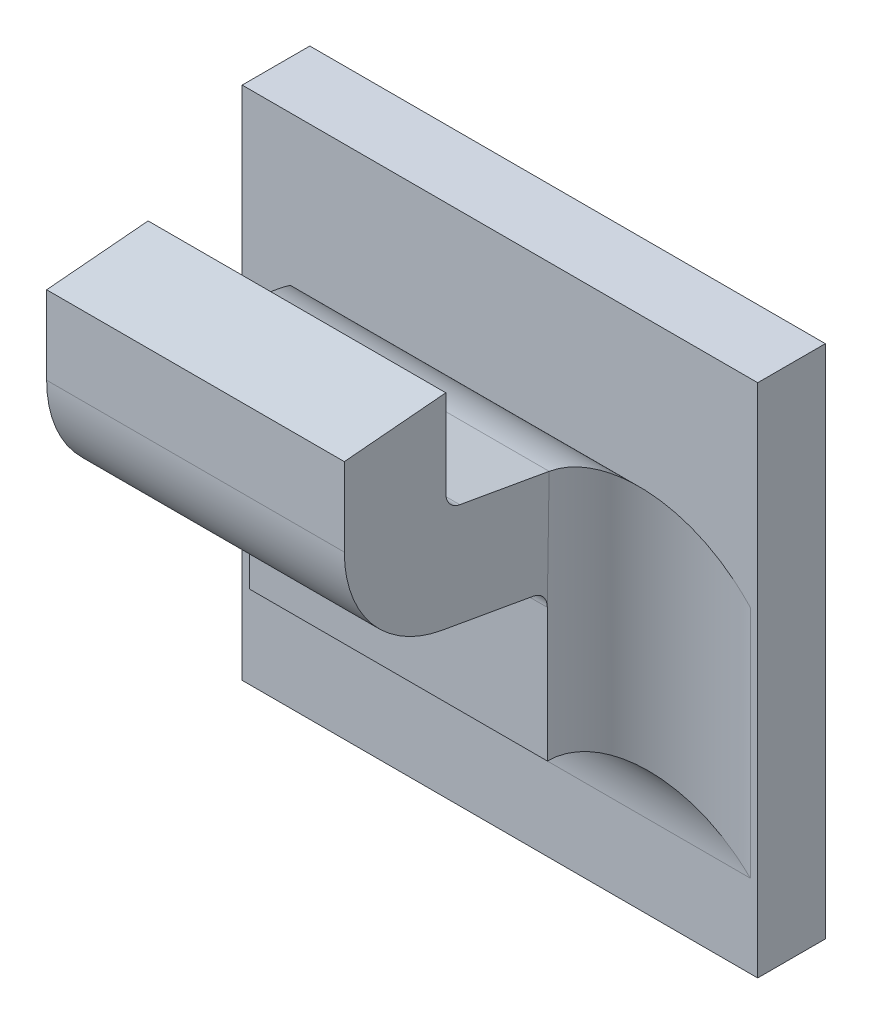
ISO-10303-21;
HEADER;
FILE_DESCRIPTION(('STEP AP214'),'2;1');
FILE_NAME('part.step','',(''),(''),'','','');
FILE_SCHEMA(('AUTOMOTIVE_DESIGN { 1 0 10303 214 1 1 1 1 }'));
ENDSEC;
DATA;
#1=APPLICATION_CONTEXT('core data for automotive mechanical design processes');
#2=APPLICATION_PROTOCOL_DEFINITION('international standard','automotive_design',2000,#1);
#3=PRODUCT_CONTEXT('',#1,'mechanical');
#4=PRODUCT('Part','Part','',(#3));
#5=PRODUCT_RELATED_PRODUCT_CATEGORY('part','',(#4));
#6=PRODUCT_DEFINITION_FORMATION('','',#4);
#7=PRODUCT_DEFINITION_CONTEXT('part definition',#1,'design');
#8=PRODUCT_DEFINITION('design','',#6,#7);
#9=PRODUCT_DEFINITION_SHAPE('','',#8);
#10=(LENGTH_UNIT() NAMED_UNIT(*) SI_UNIT(.MILLI.,.METRE.));
#11=(NAMED_UNIT(*) PLANE_ANGLE_UNIT() SI_UNIT($,.RADIAN.));
#12=(NAMED_UNIT(*) SI_UNIT($,.STERADIAN.) SOLID_ANGLE_UNIT());
#13=UNCERTAINTY_MEASURE_WITH_UNIT(LENGTH_MEASURE(1.E-05),#10,'distance_accuracy_value','');
#14=(GEOMETRIC_REPRESENTATION_CONTEXT(3) GLOBAL_UNCERTAINTY_ASSIGNED_CONTEXT((#13)) GLOBAL_UNIT_ASSIGNED_CONTEXT((#10,
#11,#12)) REPRESENTATION_CONTEXT('',''));
#15=CARTESIAN_POINT('',(0.,0.,0.));
#16=DIRECTION('',(0.,0.,1.));
#17=DIRECTION('',(1.,0.,0.));
#18=AXIS2_PLACEMENT_3D('',#15,#16,#17);
#19=CARTESIAN_POINT('',(0.879111518349957,-0.481298710143329,0.0797514586291467));
#20=DIRECTION('',(1.,0.,0.));
#21=DIRECTION('',(0.,1.,0.));
#22=AXIS2_PLACEMENT_3D('',#19,#20,#21);
#23=CYLINDRICAL_SURFACE('',#22,0.00098425196850394);
#24=DIRECTION('',(1.,0.,0.));
#25=VECTOR('',#24,1.);
#26=CARTESIAN_POINT('',(0.860056400239721,-0.481298710143329,0.0807357105976507));
#27=LINE('',#26,#25);
#28=CARTESIAN_POINT('',(0.878245376617674,-0.481298710143329,0.0807357105976507));
#29=VERTEX_POINT('',#28);
#30=CARTESIAN_POINT('',(0.860922541972005,-0.481298710143329,0.0807357105976507));
#31=VERTEX_POINT('',#30);
#32=EDGE_CURVE('E182',#29,#31,#27,.F.);
#33=ORIENTED_EDGE('',*,*,#32,.F.);
#34=CARTESIAN_POINT('',(0.878245376617674,-0.481298710143329,0.0797514586291467));
#35=DIRECTION('',(1.,0.,0.));
#36=DIRECTION('',(0.,1.,0.));
#37=AXIS2_PLACEMENT_3D('',#34,#35,#36);
#38=CIRCLE('',#37,0.00098425196850394);
#39=CARTESIAN_POINT('',(0.878245376617674,-0.482268009112829,0.0799223721898425));
#40=VERTEX_POINT('',#39);
#41=EDGE_CURVE('E155',#40,#29,#38,.F.);
#42=ORIENTED_EDGE('',*,*,#41,.F.);
#43=DIRECTION('',(1.,0.,0.));
#44=VECTOR('',#43,1.);
#45=CARTESIAN_POINT('',(0.860052207455063,-0.482268009112829,0.0799223721898425));
#46=LINE('',#45,#44);
#47=CARTESIAN_POINT('',(0.860922541972005,-0.482268009112829,0.0799223721898425));
#48=VERTEX_POINT('',#47);
#49=EDGE_CURVE('E137',#48,#40,#46,.T.);
#50=ORIENTED_EDGE('',*,*,#49,.F.);
#51=CARTESIAN_POINT('',(0.860922541972005,-0.481298710143329,0.0797514586291467));
#52=DIRECTION('',(1.,0.,0.));
#53=DIRECTION('',(0.,1.,0.));
#54=AXIS2_PLACEMENT_3D('',#51,#52,#53);
#55=CIRCLE('',#54,0.00098425196850394);
#56=EDGE_CURVE('E148',#48,#31,#55,.F.);
#57=ORIENTED_EDGE('',*,*,#56,.T.);
#58=EDGE_LOOP('',(#33,#42,#50,#57));
#59=FACE_BOUND('',#58,.T.);
#60=ADVANCED_FACE('F17',(#59),#23,.F.);
#61=CARTESIAN_POINT('',(0.860056400239721,-0.481552552937204,0.0807357105976507));
#62=DIRECTION('',(0.,0.,-1.));
#63=DIRECTION('',(0.,1.,0.));
#64=AXIS2_PLACEMENT_3D('',#61,#62,#63);
#65=PLANE('',#64);
#66=ORIENTED_EDGE('',*,*,#32,.T.);
#67=DIRECTION('',(0.,1.,0.));
#68=VECTOR('',#67,1.);
#69=CARTESIAN_POINT('',(0.860922541972005,-0.490676723073834,0.0807357105976507));
#70=LINE('',#69,#68);
#71=CARTESIAN_POINT('',(0.860922541972005,-0.476221854265821,0.0807357105976507));
#72=VERTEX_POINT('',#71);
#73=EDGE_CURVE('E177',#31,#72,#70,.T.);
#74=ORIENTED_EDGE('',*,*,#73,.T.);
#75=DIRECTION('',(1.,0.,0.));
#76=VECTOR('',#75,1.);
#77=CARTESIAN_POINT('',(0.832083959294839,-0.476221854265822,0.0807357105976506));
#78=LINE('',#77,#76);
#79=CARTESIAN_POINT('',(0.878245376617674,-0.476221854265821,0.0807357105976507));
#80=VERTEX_POINT('',#79);
#81=EDGE_CURVE('E170',#72,#80,#78,.T.);
#82=ORIENTED_EDGE('',*,*,#81,.T.);
#83=DIRECTION('',(0.,1.,0.));
#84=VECTOR('',#83,1.);
#85=CARTESIAN_POINT('',(0.878245376617674,-0.490676723073834,0.0807357105976507));
#86=LINE('',#85,#84);
#87=EDGE_CURVE('E189',#29,#80,#86,.T.);
#88=ORIENTED_EDGE('',*,*,#87,.F.);
#89=EDGE_LOOP('',(#66,#74,#82,#88));
#90=FACE_BOUND('',#89,.T.);
#91=ADVANCED_FACE('F376',(#90),#65,.T.);
#92=CARTESIAN_POINT('',(0.832083959294839,-0.476580451683761,0.0848344978403345));
#93=DIRECTION('',(0.,-0.996194698091746,-0.0871557427476516));
#94=DIRECTION('',(0.,0.0871557427476516,-0.996194698091746));
#95=AXIS2_PLACEMENT_3D('',#92,#93,#94);
#96=PLANE('',#95);
#97=DIRECTION('',(0.,-0.0871557427476629,0.996194698091745));
#98=VECTOR('',#97,1.);
#99=CARTESIAN_POINT('',(0.878245376617674,-0.476221854265821,0.0807357105976507));
#100=LINE('',#99,#98);
#101=CARTESIAN_POINT('',(0.878245376617674,-0.476738519601604,0.0866412224086743));
#102=VERTEX_POINT('',#101);
#103=EDGE_CURVE('E186',#80,#102,#100,.T.);
#104=ORIENTED_EDGE('',*,*,#103,.F.);
#105=ORIENTED_EDGE('',*,*,#81,.F.);
#106=DIRECTION('',(0.,-0.0871557427476629,0.996194698091745));
#107=VECTOR('',#106,1.);
#108=CARTESIAN_POINT('',(0.860922541972005,-0.476221854265821,0.0807357105976507));
#109=LINE('',#108,#107);
#110=CARTESIAN_POINT('',(0.860922541972005,-0.476738519601604,0.0866412224086743));
#111=VERTEX_POINT('',#110);
#112=EDGE_CURVE('E173',#72,#111,#109,.T.);
#113=ORIENTED_EDGE('',*,*,#112,.T.);
#114=DIRECTION('',(1.,0.,0.));
#115=VECTOR('',#114,1.);
#116=CARTESIAN_POINT('',(0.860056400239721,-0.476738519601604,0.0866412224086743));
#117=LINE('',#116,#115);
#118=EDGE_CURVE('E167',#111,#102,#117,.T.);
#119=ORIENTED_EDGE('',*,*,#118,.T.);
#120=EDGE_LOOP('',(#104,#105,#113,#119));
#121=FACE_BOUND('',#120,.T.);
#122=ADVANCED_FACE('F380',(#121),#96,.F.);
#123=CARTESIAN_POINT('',(0.860056400239721,-0.481526719670415,0.0866412224086743));
#124=DIRECTION('',(0.,0.,-1.));
#125=DIRECTION('',(0.,1.,0.));
#126=AXIS2_PLACEMENT_3D('',#123,#124,#125);
#127=PLANE('',#126);
#128=ORIENTED_EDGE('',*,*,#118,.F.);
#129=DIRECTION('',(0.,1.,0.));
#130=VECTOR('',#129,1.);
#131=CARTESIAN_POINT('',(0.860922541972005,-0.490676723073834,0.0866412224086743));
#132=LINE('',#131,#130);
#133=CARTESIAN_POINT('',(0.860922541972005,-0.481298710143329,0.0866412224086743));
#134=VERTEX_POINT('',#133);
#135=EDGE_CURVE('E176',#111,#134,#132,.F.);
#136=ORIENTED_EDGE('',*,*,#135,.T.);
#137=DIRECTION('',(1.,0.,0.));
#138=VECTOR('',#137,1.);
#139=CARTESIAN_POINT('',(0.879111518349957,-0.481298710143329,0.0866412224086743));
#140=LINE('',#139,#138);
#141=CARTESIAN_POINT('',(0.878245376617674,-0.481298710143329,0.0866412224086743));
#142=VERTEX_POINT('',#141);
#143=EDGE_CURVE('E165',#142,#134,#140,.F.);
#144=ORIENTED_EDGE('',*,*,#143,.F.);
#145=DIRECTION('',(0.,1.,0.));
#146=VECTOR('',#145,1.);
#147=CARTESIAN_POINT('',(0.878245376617674,-0.490676723073834,0.0866412224086743));
#148=LINE('',#147,#146);
#149=EDGE_CURVE('E188',#102,#142,#148,.F.);
#150=ORIENTED_EDGE('',*,*,#149,.F.);
#151=EDGE_LOOP('',(#128,#136,#144,#150));
#152=FACE_BOUND('',#151,.T.);
#153=ADVANCED_FACE('F384',(#152),#127,.F.);
#154=CARTESIAN_POINT('',(0.879111518349957,-0.481298710143329,0.0797514586291467));
#155=DIRECTION('',(1.,0.,0.));
#156=DIRECTION('',(0.,1.,0.));
#157=AXIS2_PLACEMENT_3D('',#154,#155,#156);
#158=CYLINDRICAL_SURFACE('',#157,0.00688976377952756);
#159=CARTESIAN_POINT('',(0.878245376617674,-0.481298710143329,0.0797514586291467));
#160=DIRECTION('',(1.,0.,0.));
#161=DIRECTION('',(0.,1.,0.));
#162=AXIS2_PLACEMENT_3D('',#159,#160,#161);
#163=CIRCLE('',#162,0.00688976377952756);
#164=CARTESIAN_POINT('',(0.878245376617674,-0.48808380292983,0.0809478535540175));
#165=VERTEX_POINT('',#164);
#166=EDGE_CURVE('E146',#142,#165,#163,.T.);
#167=ORIENTED_EDGE('',*,*,#166,.F.);
#168=ORIENTED_EDGE('',*,*,#143,.T.);
#169=CARTESIAN_POINT('',(0.860922541972005,-0.481298710143329,0.0797514586291467));
#170=DIRECTION('',(1.,0.,0.));
#171=DIRECTION('',(0.,1.,0.));
#172=AXIS2_PLACEMENT_3D('',#169,#170,#171);
#173=CIRCLE('',#172,0.00688976377952756);
#174=CARTESIAN_POINT('',(0.860922541972005,-0.48808380292983,0.0809478535540175));
#175=VERTEX_POINT('',#174);
#176=EDGE_CURVE('E235',#134,#175,#173,.T.);
#177=ORIENTED_EDGE('',*,*,#176,.T.);
#178=DIRECTION('',(1.,0.,0.));
#179=VECTOR('',#178,1.);
#180=CARTESIAN_POINT('',(0.860056400239721,-0.48808380292983,0.0809478535540173));
#181=LINE('',#180,#179);
#182=EDGE_CURVE('E138',#175,#165,#181,.T.);
#183=ORIENTED_EDGE('',*,*,#182,.T.);
#184=EDGE_LOOP('',(#167,#168,#177,#183));
#185=FACE_BOUND('',#184,.T.);
#186=ADVANCED_FACE('F388',(#185),#158,.T.);
#187=CARTESIAN_POINT('',(0.860056400239721,-0.489065861722658,0.075378321376456));
#188=DIRECTION('',(0.,0.984807753012208,-0.17364817766693));
#189=DIRECTION('',(0.,0.17364817766693,0.984807753012208));
#190=AXIS2_PLACEMENT_3D('',#187,#188,#189);
#191=PLANE('',#190);
#192=DIRECTION('',(1.,0.,0.));
#193=VECTOR('',#192,1.);
#194=CARTESIAN_POINT('',(0.879111518349957,-0.489019097018238,0.0756435371944352));
#195=LINE('',#194,#193);
#196=CARTESIAN_POINT('',(0.860922541972005,-0.489019097018238,0.0756435371944351));
#197=VERTEX_POINT('',#196);
#198=CARTESIAN_POINT('',(0.878245376617674,-0.489019097018238,0.0756435371944351));
#199=VERTEX_POINT('',#198);
#200=EDGE_CURVE('E127',#197,#199,#195,.T.);
#201=ORIENTED_EDGE('',*,*,#200,.T.);
#202=DIRECTION('',(0.,-0.173648177666998,-0.984807753012196));
#203=VECTOR('',#202,1.);
#204=CARTESIAN_POINT('',(0.878245376617674,-0.48808380292983,0.0809478535540173));
#205=LINE('',#204,#203);
#206=EDGE_CURVE('E130',#165,#199,#205,.T.);
#207=ORIENTED_EDGE('',*,*,#206,.F.);
#208=ORIENTED_EDGE('',*,*,#182,.F.);
#209=DIRECTION('',(0.,-0.173648177666998,-0.984807753012196));
#210=VECTOR('',#209,1.);
#211=CARTESIAN_POINT('',(0.860922541972005,-0.48808380292983,0.0809478535540173));
#212=LINE('',#211,#210);
#213=EDGE_CURVE('E132',#175,#197,#212,.T.);
#214=ORIENTED_EDGE('',*,*,#213,.T.);
#215=EDGE_LOOP('',(#201,#207,#208,#214));
#216=FACE_BOUND('',#215,.T.);
#217=ADVANCED_FACE('F129',(#216),#191,.F.);
#218=CARTESIAN_POINT('',(0.879111518349957,-0.489988395987738,0.0758144507551309));
#219=DIRECTION('',(1.,0.,0.));
#220=DIRECTION('',(0.,1.,0.));
#221=AXIS2_PLACEMENT_3D('',#218,#219,#220);
#222=CYLINDRICAL_SURFACE('',#221,0.00098425196850394);
#223=DIRECTION('',(1.,0.,0.));
#224=VECTOR('',#223,1.);
#225=CARTESIAN_POINT('',(0.860056400239721,-0.489988395987738,0.074830198786627));
#226=LINE('',#225,#224);
#227=CARTESIAN_POINT('',(0.860922541972005,-0.489988395987738,0.074830198786627));
#228=VERTEX_POINT('',#227);
#229=CARTESIAN_POINT('',(0.878245376617674,-0.489988395987738,0.074830198786627));
#230=VERTEX_POINT('',#229);
#231=EDGE_CURVE('E151',#228,#230,#226,.T.);
#232=ORIENTED_EDGE('',*,*,#231,.T.);
#233=CARTESIAN_POINT('',(0.878245376617674,-0.489988395987738,0.0758144507551309));
#234=DIRECTION('',(1.,0.,0.));
#235=DIRECTION('',(0.,1.,0.));
#236=AXIS2_PLACEMENT_3D('',#233,#234,#235);
#237=CIRCLE('',#236,0.00098425196850394);
#238=EDGE_CURVE('E20',#199,#230,#237,.F.);
#239=ORIENTED_EDGE('',*,*,#238,.F.);
#240=ORIENTED_EDGE('',*,*,#200,.F.);
#241=CARTESIAN_POINT('',(0.860922541972005,-0.489988395987738,0.0758144507551309));
#242=DIRECTION('',(1.,0.,0.));
#243=DIRECTION('',(0.,1.,0.));
#244=AXIS2_PLACEMENT_3D('',#241,#242,#243);
#245=CIRCLE('',#244,0.00098425196850394);
#246=EDGE_CURVE('E232',#197,#228,#245,.F.);
#247=ORIENTED_EDGE('',*,*,#246,.T.);
#248=EDGE_LOOP('',(#232,#239,#240,#247));
#249=FACE_BOUND('',#248,.T.);
#250=ADVANCED_FACE('F150',(#249),#222,.F.);
#251=CARTESIAN_POINT('',(0.860052207455063,-0.483250067905657,0.0743528400122813));
#252=DIRECTION('',(0.,0.984807753012208,-0.17364817766693));
#253=DIRECTION('',(0.,0.17364817766693,0.984807753012208));
#254=AXIS2_PLACEMENT_3D('',#251,#252,#253);
#255=PLANE('',#254);
#256=DIRECTION('',(0.,0.173648177666945,0.984807753012206));
#257=VECTOR('',#256,1.);
#258=CARTESIAN_POINT('',(0.878245376617674,-0.483165896674262,0.074830198786627));
#259=LINE('',#258,#257);
#260=CARTESIAN_POINT('',(0.878247282428882,-0.483184599937749,0.0747241273084437));
#261=VERTEX_POINT('',#260);
#262=EDGE_CURVE('E153',#261,#40,#259,.T.);
#263=ORIENTED_EDGE('',*,*,#262,.F.);
#264=DIRECTION('',(1.,0.,0.));
#265=VECTOR('',#264,1.);
#266=CARTESIAN_POINT('',(0.885607581342083,-0.483203303201237,0.0746180558302605));
#267=LINE('',#266,#265);
#268=CARTESIAN_POINT('',(0.860920636160796,-0.483184599937749,0.0747241273084437));
#269=VERTEX_POINT('',#268);
#270=EDGE_CURVE('E264',#269,#261,#267,.T.);
#271=ORIENTED_EDGE('',*,*,#270,.F.);
#272=DIRECTION('',(0.,0.173648177666945,0.984807753012206));
#273=VECTOR('',#272,1.);
#274=CARTESIAN_POINT('',(0.860922541972005,-0.483165896674262,0.074830198786627));
#275=LINE('',#274,#273);
#276=EDGE_CURVE('E234',#269,#48,#275,.T.);
#277=ORIENTED_EDGE('',*,*,#276,.T.);
#278=ORIENTED_EDGE('',*,*,#49,.T.);
#279=EDGE_LOOP('',(#263,#271,#277,#278));
#280=FACE_BOUND('',#279,.T.);
#281=ADVANCED_FACE('F373',(#280),#255,.T.);
#282=CARTESIAN_POINT('',(0.878245376617674,-0.490676723073834,0.0742396476055247));
#283=DIRECTION('',(1.,0.,0.));
#284=DIRECTION('',(0.,1.,0.));
#285=AXIS2_PLACEMENT_3D('',#282,#283,#284);
#286=PLANE('',#285);
#287=ORIENTED_EDGE('',*,*,#166,.T.);
#288=ORIENTED_EDGE('',*,*,#206,.T.);
#289=ORIENTED_EDGE('',*,*,#238,.T.);
#290=DIRECTION('',(0.,-1.,0.));
#291=VECTOR('',#290,1.);
#292=CARTESIAN_POINT('',(0.878245376617673,-0.504660414832431,0.074830198786627));
#293=LINE('',#292,#291);
#294=EDGE_CURVE('E271',#230,#261,#293,.F.);
#295=ORIENTED_EDGE('',*,*,#294,.T.);
#296=ORIENTED_EDGE('',*,*,#262,.T.);
#297=ORIENTED_EDGE('',*,*,#41,.T.);
#298=ORIENTED_EDGE('',*,*,#87,.T.);
#299=ORIENTED_EDGE('',*,*,#103,.T.);
#300=ORIENTED_EDGE('',*,*,#149,.T.);
#301=EDGE_LOOP('',(#287,#288,#289,#295,#296,#297,#298,#299,#300));
#302=FACE_BOUND('',#301,.T.);
#303=ADVANCED_FACE('F142',(#302),#286,.T.);
#304=CARTESIAN_POINT('',(0.860922541972005,-0.490676723073834,0.0742396476055247));
#305=DIRECTION('',(1.,0.,0.));
#306=DIRECTION('',(0.,1.,0.));
#307=AXIS2_PLACEMENT_3D('',#304,#305,#306);
#308=PLANE('',#307);
#309=DIRECTION('',(0.,1.,0.));
#310=VECTOR('',#309,1.);
#311=CARTESIAN_POINT('',(0.860922541972005,-0.482142348190539,0.074830198786627));
#312=LINE('',#311,#310);
#313=EDGE_CURVE('E290',#269,#228,#312,.F.);
#314=ORIENTED_EDGE('',*,*,#313,.T.);
#315=ORIENTED_EDGE('',*,*,#246,.F.);
#316=ORIENTED_EDGE('',*,*,#213,.F.);
#317=ORIENTED_EDGE('',*,*,#176,.F.);
#318=ORIENTED_EDGE('',*,*,#135,.F.);
#319=ORIENTED_EDGE('',*,*,#112,.F.);
#320=ORIENTED_EDGE('',*,*,#73,.F.);
#321=ORIENTED_EDGE('',*,*,#56,.F.);
#322=ORIENTED_EDGE('',*,*,#276,.F.);
#323=EDGE_LOOP('',(#314,#315,#316,#317,#318,#319,#320,#321,#322));
#324=FACE_BOUND('',#323,.T.);
#325=ADVANCED_FACE('F371',(#324),#308,.F.);
#326=CARTESIAN_POINT('',(0.860056400239721,-0.498118502465182,0.074830198786627));
#327=DIRECTION('',(0.,0.,-1.));
#328=DIRECTION('',(0.,1.,0.));
#329=AXIS2_PLACEMENT_3D('',#326,#327,#328);
#330=PLANE('',#329);
#331=DIRECTION('',(-1.,0.,0.));
#332=VECTOR('',#331,1.);
#333=CARTESIAN_POINT('',(0.832083959294839,-0.497731354537685,0.074830198786627));
#334=LINE('',#333,#332);
#335=CARTESIAN_POINT('',(0.860922541972005,-0.497731354537685,0.074830198786627));
#336=VERTEX_POINT('',#335);
#337=CARTESIAN_POINT('',(0.878245376617673,-0.497731354537685,0.074830198786627));
#338=VERTEX_POINT('',#337);
#339=EDGE_CURVE('E275',#336,#338,#334,.F.);
#340=ORIENTED_EDGE('',*,*,#339,.T.);
#341=DIRECTION('',(0.,-1.,0.));
#342=VECTOR('',#341,1.);
#343=CARTESIAN_POINT('',(0.878245376617673,-0.504660414832431,0.074830198786627));
#344=LINE('',#343,#342);
#345=EDGE_CURVE('E268',#338,#230,#344,.F.);
#346=ORIENTED_EDGE('',*,*,#345,.T.);
#347=ORIENTED_EDGE('',*,*,#231,.F.);
#348=DIRECTION('',(0.,1.,0.));
#349=VECTOR('',#348,1.);
#350=CARTESIAN_POINT('',(0.860922541972005,-0.482142348190539,0.074830198786627));
#351=LINE('',#350,#349);
#352=EDGE_CURVE('E293',#228,#336,#351,.F.);
#353=ORIENTED_EDGE('',*,*,#352,.T.);
#354=EDGE_LOOP('',(#340,#346,#347,#353));
#355=FACE_BOUND('',#354,.T.);
#356=ADVANCED_FACE('F369',(#355),#330,.F.);
#357=CARTESIAN_POINT('',(0.885607581342083,-0.489988395987738,0.0758144507551309));
#358=DIRECTION('',(1.,0.,0.));
#359=DIRECTION('',(0.,1.,0.));
#360=AXIS2_PLACEMENT_3D('',#357,#358,#359);
#361=CYLINDRICAL_SURFACE('',#360,0.00688976377952756);
#362=ORIENTED_EDGE('',*,*,#270,.T.);
#363=CARTESIAN_POINT('',(0.878246382593822,-0.483185488579863,0.0747242535477703));
#364=CARTESIAN_POINT('',(0.87825128194199,-0.483232266027787,0.0744293553553975));
#365=CARTESIAN_POINT('',(0.878278884572725,-0.483298823939585,0.0741391660738235));
#366=CARTESIAN_POINT('',(0.878372824924848,-0.483465339173824,0.0735779766513714));
#367=CARTESIAN_POINT('',(0.878438794444158,-0.483564975201296,0.073306821195812));
#368=CARTESIAN_POINT('',(0.878602778162369,-0.483792090427847,0.0727887375004896));
#369=CARTESIAN_POINT('',(0.878700655286949,-0.483919449764025,0.0725417113993396));
#370=CARTESIAN_POINT('',(0.87892225674358,-0.484196815183936,0.0720726852306902));
#371=CARTESIAN_POINT('',(0.879046047828158,-0.484346879471711,0.071850752120349));
#372=CARTESIAN_POINT('',(0.879382315788507,-0.484745897905248,0.071326423454796));
#373=CARTESIAN_POINT('',(0.879607765363317,-0.485006169183649,0.0710409452665381));
#374=CARTESIAN_POINT('',(0.880089841992869,-0.485553804988474,0.0705281886247574));
#375=CARTESIAN_POINT('',(0.880346540514468,-0.485841231269787,0.0703010474198589));
#376=CARTESIAN_POINT('',(0.880980590718541,-0.486544894865211,0.0698267645837302));
#377=CARTESIAN_POINT('',(0.881367179348042,-0.486969125966213,0.0696038752443972));
#378=CARTESIAN_POINT('',(0.882161035516566,-0.487835246032007,0.0692531254101266));
#379=CARTESIAN_POINT('',(0.882568287311545,-0.488277121499792,0.0691251936913979));
#380=CARTESIAN_POINT('',(0.883249955199605,-0.489015004077301,0.0689873300019178));
#381=CARTESIAN_POINT('',(0.883521835079522,-0.489308858114222,0.06895193709532));
#382=CARTESIAN_POINT('',(0.883913068498066,-0.489731521036954,0.0689282813392202));
#383=CARTESIAN_POINT('',(0.884031983925358,-0.48985996419474,0.0689246964591274));
#384=CARTESIAN_POINT('',(0.884150888428697,-0.489988395987738,0.0689246869756034));
#385=B_SPLINE_CURVE_WITH_KNOTS('',3,(#363,#364,#365,#366,#367,#368,#369,#370,#371,#372,#373,
#374,#375,#376,#377,#378,#379,#380,#381,#382,#383,#384),.UNSPECIFIED.,.F.,.F.,(4,2,2,2,2,2,2,2,
2,2,4),(0.,0.000892674275674697,0.00177691981761755,0.00265741564566989,0.00354020811045539,
0.00487460341316188,0.00621210995073968,0.00804949445936676,0.00988549942521242,0.011089431284,
0.0116145091100796),.UNSPECIFIED.);
#386=CARTESIAN_POINT('',(0.884150888428697,-0.489988395987738,0.0689246869756034));
#387=VERTEX_POINT('',#386);
#388=EDGE_CURVE('E231',#261,#387,#385,.T.);
#389=ORIENTED_EDGE('',*,*,#388,.T.);
#390=DIRECTION('',(1.,0.,0.));
#391=VECTOR('',#390,1.);
#392=CARTESIAN_POINT('',(0.832083959294839,-0.489988395987738,0.0689246869756034));
#393=LINE('',#392,#391);
#394=CARTESIAN_POINT('',(0.855017030160981,-0.489988395987738,0.0689246869756034));
#395=VERTEX_POINT('',#394);
#396=EDGE_CURVE('E195',#395,#387,#393,.T.);
#397=ORIENTED_EDGE('',*,*,#396,.F.);
#398=CARTESIAN_POINT('',(0.860921535995856,-0.483185488579862,0.0747242535477702));
#399=CARTESIAN_POINT('',(0.860916636647689,-0.483232266027787,0.0744293553553975));
#400=CARTESIAN_POINT('',(0.860889034016953,-0.483298823939584,0.0741391660738235));
#401=CARTESIAN_POINT('',(0.86079509366483,-0.483465339173825,0.0735779766513714));
#402=CARTESIAN_POINT('',(0.86072912414552,-0.483564975201296,0.073306821195812));
#403=CARTESIAN_POINT('',(0.860565140427309,-0.483792090427846,0.0727887375004896));
#404=CARTESIAN_POINT('',(0.860467263302729,-0.483919449764025,0.0725417113993396));
#405=CARTESIAN_POINT('',(0.860245661846098,-0.484196815183936,0.0720726852306902));
#406=CARTESIAN_POINT('',(0.86012187076152,-0.484346879471711,0.071850752120349));
#407=CARTESIAN_POINT('',(0.859785602801171,-0.484745897905248,0.071326423454796));
#408=CARTESIAN_POINT('',(0.859560153226361,-0.485006169183649,0.0710409452665382));
#409=CARTESIAN_POINT('',(0.859078076596809,-0.485553804988474,0.0705281886247574));
#410=CARTESIAN_POINT('',(0.85882137807521,-0.485841231269787,0.0703010474198589));
#411=CARTESIAN_POINT('',(0.858187327871137,-0.486544894865211,0.0698267645837302));
#412=CARTESIAN_POINT('',(0.857800739241636,-0.486969125966213,0.0696038752443972));
#413=CARTESIAN_POINT('',(0.857006883073112,-0.487835246032007,0.0692531254101266));
#414=CARTESIAN_POINT('',(0.856599631278133,-0.488277121499792,0.0691251936913979));
#415=CARTESIAN_POINT('',(0.855917963390073,-0.489015004077301,0.0689873300019178));
#416=CARTESIAN_POINT('',(0.855646083510156,-0.489308858114222,0.06895193709532));
#417=CARTESIAN_POINT('',(0.855254850091612,-0.489731521036954,0.0689282813392202));
#418=CARTESIAN_POINT('',(0.85513593466432,-0.48985996419474,0.0689246964591274));
#419=CARTESIAN_POINT('',(0.855017030160981,-0.489988395987738,0.0689246869756034));
#420=B_SPLINE_CURVE_WITH_KNOTS('',3,(#398,#399,#400,#401,#402,#403,#404,#405,#406,#407,#408,
#409,#410,#411,#412,#413,#414,#415,#416,#417,#418,#419),.UNSPECIFIED.,.F.,.F.,(4,2,2,2,2,2,2,2,
2,2,4),(0.,0.000892674275674728,0.00177691981761757,0.00265741564566992,0.00354020811045542,
0.00487460341316191,0.00621210995073965,0.00804949445936676,0.00988549942521237,
0.0110894312840001,0.0116145091100797),.UNSPECIFIED.);
#421=EDGE_CURVE('E192',#395,#269,#420,.F.);
#422=ORIENTED_EDGE('',*,*,#421,.T.);
#423=EDGE_LOOP('',(#362,#389,#397,#422));
#424=FACE_BOUND('',#423,.T.);
#425=ADVANCED_FACE('F205',(#424),#361,.T.);
#426=CARTESIAN_POINT('',(0.884150888428697,-0.504660414832431,0.074830198786627));
#427=DIRECTION('',(0.,-1.,0.));
#428=DIRECTION('',(1.,0.,0.));
#429=AXIS2_PLACEMENT_3D('',#426,#427,#428);
#430=CYLINDRICAL_SURFACE('',#429,0.00590551181102362);
#431=ORIENTED_EDGE('',*,*,#345,.F.);
#432=CARTESIAN_POINT('',(0.884150888428697,-0.503636866348709,0.074830198786627));
#433=DIRECTION('',(-0.707106781186548,-0.707106781186547,0.));
#434=DIRECTION('',(0.707106781186547,-0.707106781186548,0.));
#435=AXIS2_PLACEMENT_3D('',#432,#433,#434);
#436=ELLIPSE('',#435,0.0083516548959041,0.00590551181102362);
#437=CARTESIAN_POINT('',(0.884150888428697,-0.503636866348709,0.0689246869756034));
#438=VERTEX_POINT('',#437);
#439=EDGE_CURVE('E281',#338,#438,#436,.T.);
#440=ORIENTED_EDGE('',*,*,#439,.T.);
#441=DIRECTION('',(0.,-1.,0.));
#442=VECTOR('',#441,1.);
#443=CARTESIAN_POINT('',(0.884150888428697,-0.449179464483494,0.0689246869756034));
#444=LINE('',#443,#442);
#445=EDGE_CURVE('E276',#387,#438,#444,.T.);
#446=ORIENTED_EDGE('',*,*,#445,.F.);
#447=ORIENTED_EDGE('',*,*,#388,.F.);
#448=ORIENTED_EDGE('',*,*,#294,.F.);
#449=EDGE_LOOP('',(#431,#440,#446,#447,#448));
#450=FACE_BOUND('',#449,.T.);
#451=ADVANCED_FACE('F219',(#450),#430,.F.);
#452=CARTESIAN_POINT('',(0.832083959294839,-0.503636866348709,0.074830198786627));
#453=DIRECTION('',(-1.,0.,0.));
#454=DIRECTION('',(0.,-1.,0.));
#455=AXIS2_PLACEMENT_3D('',#452,#453,#454);
#456=CYLINDRICAL_SURFACE('',#455,0.00590551181102362);
#457=DIRECTION('',(1.,0.,0.));
#458=VECTOR('',#457,1.);
#459=CARTESIAN_POINT('',(0.832083959294839,-0.503636866348709,0.0689246869756034));
#460=LINE('',#459,#458);
#461=CARTESIAN_POINT('',(0.855017030160981,-0.503636866348709,0.0689246869756034));
#462=VERTEX_POINT('',#461);
#463=EDGE_CURVE('E278',#438,#462,#460,.F.);
#464=ORIENTED_EDGE('',*,*,#463,.F.);
#465=ORIENTED_EDGE('',*,*,#439,.F.);
#466=ORIENTED_EDGE('',*,*,#339,.F.);
#467=CARTESIAN_POINT('',(0.855017030160981,-0.503636866348709,0.074830198786627));
#468=DIRECTION('',(-0.707106781186547,0.707106781186548,0.));
#469=DIRECTION('',(-0.707106781186548,-0.707106781186547,0.));
#470=AXIS2_PLACEMENT_3D('',#467,#468,#469);
#471=ELLIPSE('',#470,0.0083516548959041,0.00590551181102362);
#472=EDGE_CURVE('E196',#336,#462,#471,.T.);
#473=ORIENTED_EDGE('',*,*,#472,.T.);
#474=EDGE_LOOP('',(#464,#465,#466,#473));
#475=FACE_BOUND('',#474,.T.);
#476=ADVANCED_FACE('F215',(#475),#456,.F.);
#477=CARTESIAN_POINT('',(0.855017030160981,-0.482142348190539,0.074830198786627));
#478=DIRECTION('',(0.,1.,0.));
#479=DIRECTION('',(-1.,0.,0.));
#480=AXIS2_PLACEMENT_3D('',#477,#478,#479);
#481=CYLINDRICAL_SURFACE('',#480,0.00590551181102362);
#482=DIRECTION('',(0.,-1.,0.));
#483=VECTOR('',#482,1.);
#484=CARTESIAN_POINT('',(0.855017030160981,-0.449179464483494,0.0689246869756034));
#485=LINE('',#484,#483);
#486=EDGE_CURVE('E283',#462,#395,#485,.F.);
#487=ORIENTED_EDGE('',*,*,#486,.F.);
#488=ORIENTED_EDGE('',*,*,#472,.F.);
#489=ORIENTED_EDGE('',*,*,#352,.F.);
#490=ORIENTED_EDGE('',*,*,#313,.F.);
#491=ORIENTED_EDGE('',*,*,#421,.F.);
#492=EDGE_LOOP('',(#487,#488,#489,#490,#491));
#493=FACE_BOUND('',#492,.T.);
#494=ADVANCED_FACE('F209',(#493),#481,.F.);
#495=CARTESIAN_POINT('',(0.832083959294839,-0.449179464483494,0.0689246869756034));
#496=DIRECTION('',(0.,0.,1.));
#497=DIRECTION('',(0.,-1.,0.));
#498=AXIS2_PLACEMENT_3D('',#495,#496,#497);
#499=PLANE('',#498);
#500=ORIENTED_EDGE('',*,*,#463,.T.);
#501=ORIENTED_EDGE('',*,*,#486,.T.);
#502=ORIENTED_EDGE('',*,*,#396,.T.);
#503=ORIENTED_EDGE('',*,*,#445,.T.);
#504=EDGE_LOOP('',(#500,#501,#502,#503));
#505=FACE_BOUND('',#504,.T.);
#506=DIRECTION('',(0.,-1.,0.));
#507=VECTOR('',#506,1.);
#508=CARTESIAN_POINT('',(0.884583959294839,-0.476950817143496,0.0689246869756034));
#509=LINE('',#508,#507);
#510=CARTESIAN_POINT('',(0.884583959294839,-0.508450817143496,0.0689246869756034));
#511=VERTEX_POINT('',#510);
#512=CARTESIAN_POINT('',(0.884583959294839,-0.478450817143496,0.0689246869756034));
#513=VERTEX_POINT('',#512);
#514=EDGE_CURVE('E300',#511,#513,#509,.F.);
#515=ORIENTED_EDGE('',*,*,#514,.T.);
#516=DIRECTION('',(1.,0.,0.));
#517=VECTOR('',#516,1.);
#518=CARTESIAN_POINT('',(0.853083959294839,-0.478450817143496,0.0689246869756034));
#519=LINE('',#518,#517);
#520=CARTESIAN_POINT('',(0.854583959294839,-0.478450817143496,0.0689246869756034));
#521=VERTEX_POINT('',#520);
#522=EDGE_CURVE('E305',#513,#521,#519,.F.);
#523=ORIENTED_EDGE('',*,*,#522,.T.);
#524=DIRECTION('',(0.,1.,0.));
#525=VECTOR('',#524,1.);
#526=CARTESIAN_POINT('',(0.854583959294839,-0.509950817143496,0.0689246869756034));
#527=LINE('',#526,#525);
#528=CARTESIAN_POINT('',(0.854583959294839,-0.508450817143496,0.0689246869756034));
#529=VERTEX_POINT('',#528);
#530=EDGE_CURVE('E308',#521,#529,#527,.F.);
#531=ORIENTED_EDGE('',*,*,#530,.T.);
#532=DIRECTION('',(-1.,0.,0.));
#533=VECTOR('',#532,1.);
#534=CARTESIAN_POINT('',(0.886083959294839,-0.508450817143496,0.0689246869756034));
#535=LINE('',#534,#533);
#536=EDGE_CURVE('E286',#529,#511,#535,.F.);
#537=ORIENTED_EDGE('',*,*,#536,.T.);
#538=EDGE_LOOP('',(#515,#523,#531,#537));
#539=FACE_BOUND('',#538,.T.);
#540=ADVANCED_FACE('F214',(#505,#539),#499,.T.);
#541=CARTESIAN_POINT('',(0.886083959294839,-0.508450817143496,0.0647908287078869));
#542=DIRECTION('',(0.,1.,0.));
#543=DIRECTION('',(-1.,0.,0.));
#544=AXIS2_PLACEMENT_3D('',#541,#542,#543);
#545=PLANE('',#544);
#546=DIRECTION('',(0.,0.,1.));
#547=VECTOR('',#546,1.);
#548=CARTESIAN_POINT('',(0.884583959294839,-0.508450817143496,0.0647908287078869));
#549=LINE('',#548,#547);
#550=CARTESIAN_POINT('',(0.884583959294839,-0.508450817143496,0.0649876791015876));
#551=VERTEX_POINT('',#550);
#552=EDGE_CURVE('E297',#551,#511,#549,.T.);
#553=ORIENTED_EDGE('',*,*,#552,.T.);
#554=ORIENTED_EDGE('',*,*,#536,.F.);
#555=DIRECTION('',(0.,0.,1.));
#556=VECTOR('',#555,1.);
#557=CARTESIAN_POINT('',(0.854583959294839,-0.508450817143496,0.0647908287078869));
#558=LINE('',#557,#556);
#559=CARTESIAN_POINT('',(0.854583959294839,-0.508450817143496,0.0649876791015876));
#560=VERTEX_POINT('',#559);
#561=EDGE_CURVE('E311',#529,#560,#558,.F.);
#562=ORIENTED_EDGE('',*,*,#561,.T.);
#563=DIRECTION('',(1.,0.,0.));
#564=VECTOR('',#563,1.);
#565=CARTESIAN_POINT('',(0.832083959294839,-0.508450817143496,0.0649876791015877));
#566=LINE('',#565,#564);
#567=EDGE_CURVE('E314',#560,#551,#566,.T.);
#568=ORIENTED_EDGE('',*,*,#567,.T.);
#569=EDGE_LOOP('',(#553,#554,#562,#568));
#570=FACE_BOUND('',#569,.T.);
#571=ADVANCED_FACE('F332',(#570),#545,.F.);
#572=CARTESIAN_POINT('',(0.884583959294839,-0.476950817143496,0.0647908287078869));
#573=DIRECTION('',(-1.,0.,0.));
#574=DIRECTION('',(0.,-1.,0.));
#575=AXIS2_PLACEMENT_3D('',#572,#573,#574);
#576=PLANE('',#575);
#577=DIRECTION('',(0.,0.,1.));
#578=VECTOR('',#577,1.);
#579=CARTESIAN_POINT('',(0.884583959294839,-0.478450817143496,0.0647908287078869));
#580=LINE('',#579,#578);
#581=CARTESIAN_POINT('',(0.884583959294839,-0.478450817143496,0.0649876791015877));
#582=VERTEX_POINT('',#581);
#583=EDGE_CURVE('E302',#582,#513,#580,.T.);
#584=ORIENTED_EDGE('',*,*,#583,.T.);
#585=ORIENTED_EDGE('',*,*,#514,.F.);
#586=ORIENTED_EDGE('',*,*,#552,.F.);
#587=DIRECTION('',(0.,-1.,0.));
#588=VECTOR('',#587,1.);
#589=CARTESIAN_POINT('',(0.884583959294839,-0.449179464483494,0.0649876791015877));
#590=LINE('',#589,#588);
#591=EDGE_CURVE('E317',#551,#582,#590,.F.);
#592=ORIENTED_EDGE('',*,*,#591,.T.);
#593=EDGE_LOOP('',(#584,#585,#586,#592));
#594=FACE_BOUND('',#593,.T.);
#595=ADVANCED_FACE('F329',(#594),#576,.F.);
#596=CARTESIAN_POINT('',(0.853083959294839,-0.478450817143496,0.0647908287078869));
#597=DIRECTION('',(0.,-1.,0.));
#598=DIRECTION('',(1.,0.,0.));
#599=AXIS2_PLACEMENT_3D('',#596,#597,#598);
#600=PLANE('',#599);
#601=DIRECTION('',(0.,0.,1.));
#602=VECTOR('',#601,1.);
#603=CARTESIAN_POINT('',(0.854583959294839,-0.478450817143496,0.0647908287078869));
#604=LINE('',#603,#602);
#605=CARTESIAN_POINT('',(0.854583959294839,-0.478450817143496,0.0649876791015877));
#606=VERTEX_POINT('',#605);
#607=EDGE_CURVE('E34',#606,#521,#604,.T.);
#608=ORIENTED_EDGE('',*,*,#607,.T.);
#609=ORIENTED_EDGE('',*,*,#522,.F.);
#610=ORIENTED_EDGE('',*,*,#583,.F.);
#611=DIRECTION('',(1.,0.,0.));
#612=VECTOR('',#611,1.);
#613=CARTESIAN_POINT('',(0.832083959294839,-0.478450817143496,0.0649876791015877));
#614=LINE('',#613,#612);
#615=EDGE_CURVE('E26',#582,#606,#614,.F.);
#616=ORIENTED_EDGE('',*,*,#615,.T.);
#617=EDGE_LOOP('',(#608,#609,#610,#616));
#618=FACE_BOUND('',#617,.T.);
#619=ADVANCED_FACE('F323',(#618),#600,.F.);
#620=CARTESIAN_POINT('',(0.854583959294839,-0.509950817143496,0.0647908287078869));
#621=DIRECTION('',(1.,0.,0.));
#622=DIRECTION('',(0.,1.,0.));
#623=AXIS2_PLACEMENT_3D('',#620,#621,#622);
#624=PLANE('',#623);
#625=ORIENTED_EDGE('',*,*,#561,.F.);
#626=ORIENTED_EDGE('',*,*,#530,.F.);
#627=ORIENTED_EDGE('',*,*,#607,.F.);
#628=DIRECTION('',(0.,-1.,0.));
#629=VECTOR('',#628,1.);
#630=CARTESIAN_POINT('',(0.854583959294839,-0.449179464483494,0.0649876791015877));
#631=LINE('',#630,#629);
#632=EDGE_CURVE('E11',#606,#560,#631,.T.);
#633=ORIENTED_EDGE('',*,*,#632,.T.);
#634=EDGE_LOOP('',(#625,#626,#627,#633));
#635=FACE_BOUND('',#634,.T.);
#636=ADVANCED_FACE('F334',(#635),#624,.F.);
#637=CARTESIAN_POINT('',(0.832083959294839,-0.449179464483494,0.0649876791015877));
#638=DIRECTION('',(0.,0.,1.));
#639=DIRECTION('',(0.,-1.,0.));
#640=AXIS2_PLACEMENT_3D('',#637,#638,#639);
#641=PLANE('',#640);
#642=ORIENTED_EDGE('',*,*,#615,.F.);
#643=ORIENTED_EDGE('',*,*,#591,.F.);
#644=ORIENTED_EDGE('',*,*,#567,.F.);
#645=ORIENTED_EDGE('',*,*,#632,.F.);
#646=EDGE_LOOP('',(#642,#643,#644,#645));
#647=FACE_BOUND('',#646,.T.);
#648=ADVANCED_FACE('F327',(#647),#641,.F.);
#649=CLOSED_SHELL('',(#60,#91,#122,#153,#186,#217,#250,#281,#303,#325,#356,#425,#451,#476,#494,
#540,#571,#595,#619,#636,#648));
#650=MANIFOLD_SOLID_BREP('B1',#649);
#651=ADVANCED_BREP_SHAPE_REPRESENTATION('',(#18,#650),#14);
#652=SHAPE_DEFINITION_REPRESENTATION(#9,#651);
ENDSEC;
END-ISO-10303-21;
